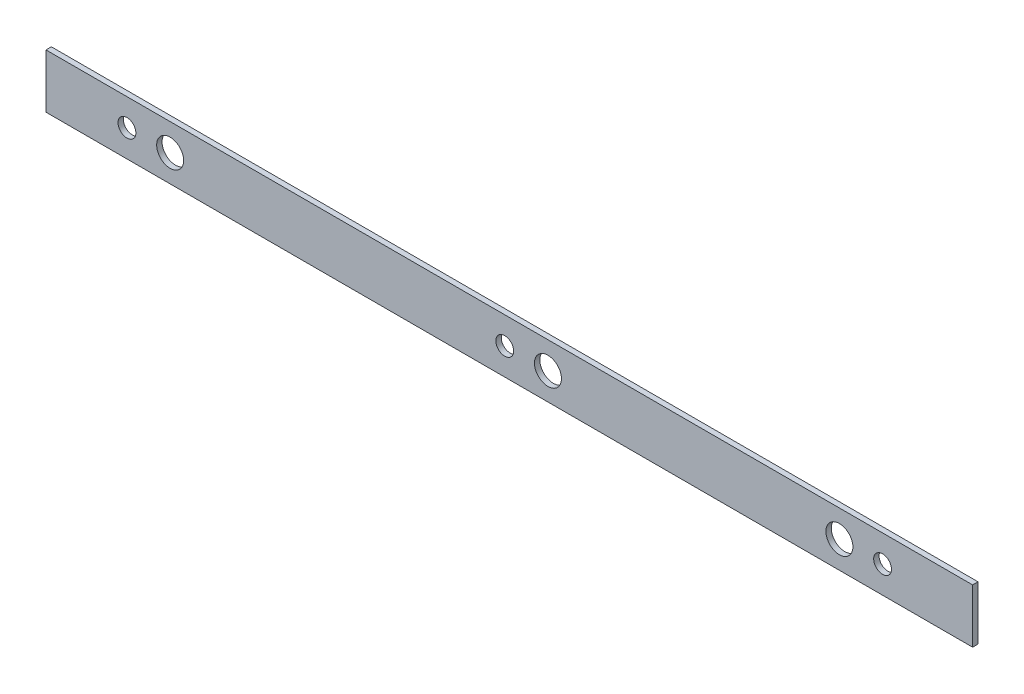
ISO-10303-21;
HEADER;
FILE_DESCRIPTION(('STEP AP214'),'2;1');
FILE_NAME('part.step','',(''),(''),'','','');
FILE_SCHEMA(('AUTOMOTIVE_DESIGN { 1 0 10303 214 1 1 1 1 }'));
ENDSEC;
DATA;
#1=APPLICATION_CONTEXT('core data for automotive mechanical design processes');
#2=APPLICATION_PROTOCOL_DEFINITION('international standard','automotive_design',2000,#1);
#3=PRODUCT_CONTEXT('',#1,'mechanical');
#4=PRODUCT('Part','Part','',(#3));
#5=PRODUCT_RELATED_PRODUCT_CATEGORY('part','',(#4));
#6=PRODUCT_DEFINITION_FORMATION('','',#4);
#7=PRODUCT_DEFINITION_CONTEXT('part definition',#1,'design');
#8=PRODUCT_DEFINITION('design','',#6,#7);
#9=PRODUCT_DEFINITION_SHAPE('','',#8);
#10=(LENGTH_UNIT() NAMED_UNIT(*) SI_UNIT(.MILLI.,.METRE.));
#11=(NAMED_UNIT(*) PLANE_ANGLE_UNIT() SI_UNIT($,.RADIAN.));
#12=(NAMED_UNIT(*) SI_UNIT($,.STERADIAN.) SOLID_ANGLE_UNIT());
#13=UNCERTAINTY_MEASURE_WITH_UNIT(LENGTH_MEASURE(1.E-05),#10,'distance_accuracy_value','');
#14=(GEOMETRIC_REPRESENTATION_CONTEXT(3) GLOBAL_UNCERTAINTY_ASSIGNED_CONTEXT((#13)) GLOBAL_UNIT_ASSIGNED_CONTEXT((#10,
#11,#12)) REPRESENTATION_CONTEXT('',''));
#15=CARTESIAN_POINT('',(0.,0.,0.));
#16=DIRECTION('',(0.,0.,1.));
#17=DIRECTION('',(1.,0.,0.));
#18=AXIS2_PLACEMENT_3D('',#15,#16,#17);
#19=CARTESIAN_POINT('',(0.,0.,1.));
#20=DIRECTION('',(0.,0.,1.));
#21=DIRECTION('',(1.,0.,0.));
#22=AXIS2_PLACEMENT_3D('',#19,#20,#21);
#23=PLANE('',#22);
#24=CARTESIAN_POINT('',(-76.1002778115,267.5,1.));
#25=DIRECTION('',(0.,0.,1.));
#26=DIRECTION('',(1.,0.,0.));
#27=AXIS2_PLACEMENT_3D('',#24,#25,#26);
#28=CIRCLE('',#27,2.50000000000001);
#29=CARTESIAN_POINT('',(-73.6002778115,267.5,1.));
#30=VERTEX_POINT('',#29);
#31=EDGE_CURVE('E166',#30,#30,#28,.T.);
#32=ORIENTED_EDGE('',*,*,#31,.F.);
#33=EDGE_LOOP('',(#32));
#34=FACE_BOUND('',#33,.T.);
#35=CARTESIAN_POINT('',(-138.1002778115,267.5,1.));
#36=DIRECTION('',(0.,0.,1.));
#37=DIRECTION('',(1.,0.,0.));
#38=AXIS2_PLACEMENT_3D('',#35,#36,#37);
#39=CIRCLE('',#38,1.65000000000002);
#40=CARTESIAN_POINT('',(-136.4502778115,267.5,1.));
#41=VERTEX_POINT('',#40);
#42=EDGE_CURVE('E150',#41,#41,#39,.T.);
#43=ORIENTED_EDGE('',*,*,#42,.F.);
#44=EDGE_LOOP('',(#43));
#45=FACE_BOUND('',#44,.T.);
#46=CARTESIAN_POINT('',(-200.1002778115,267.5,1.));
#47=DIRECTION('',(0.,0.,1.));
#48=DIRECTION('',(1.,0.,0.));
#49=AXIS2_PLACEMENT_3D('',#46,#47,#48);
#50=CIRCLE('',#49,2.5);
#51=CARTESIAN_POINT('',(-197.6002778115,267.5,1.));
#52=VERTEX_POINT('',#51);
#53=EDGE_CURVE('E116',#52,#52,#50,.T.);
#54=ORIENTED_EDGE('',*,*,#53,.F.);
#55=EDGE_LOOP('',(#54));
#56=FACE_BOUND('',#55,.T.);
#57=DIRECTION('',(0.,-1.,0.));
#58=VECTOR('',#57,1.);
#59=CARTESIAN_POINT('',(-223.1002778115,272.5,1.));
#60=LINE('',#59,#58);
#61=CARTESIAN_POINT('',(-223.1002778115,272.5,1.));
#62=VERTEX_POINT('',#61);
#63=CARTESIAN_POINT('',(-223.1002778115,262.5,1.));
#64=VERTEX_POINT('',#63);
#65=EDGE_CURVE('E94',#62,#64,#60,.T.);
#66=ORIENTED_EDGE('',*,*,#65,.T.);
#67=DIRECTION('',(1.,0.,0.));
#68=VECTOR('',#67,1.);
#69=CARTESIAN_POINT('',(-223.1002778115,262.5,1.));
#70=LINE('',#69,#68);
#71=CARTESIAN_POINT('',(-51.419079965,262.5,1.));
#72=VERTEX_POINT('',#71);
#73=EDGE_CURVE('E89',#64,#72,#70,.T.);
#74=ORIENTED_EDGE('',*,*,#73,.T.);
#75=DIRECTION('',(0.,1.,0.));
#76=VECTOR('',#75,1.);
#77=CARTESIAN_POINT('',(-51.419079965,272.5,1.));
#78=LINE('',#77,#76);
#79=CARTESIAN_POINT('',(-51.419079965,272.5,1.));
#80=VERTEX_POINT('',#79);
#81=EDGE_CURVE('E92',#72,#80,#78,.T.);
#82=ORIENTED_EDGE('',*,*,#81,.T.);
#83=DIRECTION('',(-1.,0.,0.));
#84=VECTOR('',#83,1.);
#85=CARTESIAN_POINT('',(-223.1002778115,272.5,1.));
#86=LINE('',#85,#84);
#87=EDGE_CURVE('E59',#80,#62,#86,.T.);
#88=ORIENTED_EDGE('',*,*,#87,.T.);
#89=EDGE_LOOP('',(#66,#74,#82,#88));
#90=FACE_BOUND('',#89,.T.);
#91=CARTESIAN_POINT('',(-208.1002778115,267.5,1.));
#92=DIRECTION('',(0.,0.,1.));
#93=DIRECTION('',(1.,0.,0.));
#94=AXIS2_PLACEMENT_3D('',#91,#92,#93);
#95=CIRCLE('',#94,1.65000000000002);
#96=CARTESIAN_POINT('',(-206.4502778115,267.5,1.));
#97=VERTEX_POINT('',#96);
#98=EDGE_CURVE('E142',#97,#97,#95,.T.);
#99=ORIENTED_EDGE('',*,*,#98,.F.);
#100=EDGE_LOOP('',(#99));
#101=FACE_BOUND('',#100,.T.);
#102=CARTESIAN_POINT('',(-130.1002778115,267.5,1.));
#103=DIRECTION('',(0.,0.,1.));
#104=DIRECTION('',(1.,0.,0.));
#105=AXIS2_PLACEMENT_3D('',#102,#103,#104);
#106=CIRCLE('',#105,2.5);
#107=CARTESIAN_POINT('',(-127.6002778115,267.5,1.));
#108=VERTEX_POINT('',#107);
#109=EDGE_CURVE('E158',#108,#108,#106,.T.);
#110=ORIENTED_EDGE('',*,*,#109,.F.);
#111=EDGE_LOOP('',(#110));
#112=FACE_BOUND('',#111,.T.);
#113=CARTESIAN_POINT('',(-68.1002778115,267.5,1.));
#114=DIRECTION('',(0.,0.,1.));
#115=DIRECTION('',(1.,0.,0.));
#116=AXIS2_PLACEMENT_3D('',#113,#114,#115);
#117=CIRCLE('',#116,1.65000000000001);
#118=CARTESIAN_POINT('',(-66.4502778115,267.5,1.));
#119=VERTEX_POINT('',#118);
#120=EDGE_CURVE('E174',#119,#119,#117,.T.);
#121=ORIENTED_EDGE('',*,*,#120,.F.);
#122=EDGE_LOOP('',(#121));
#123=FACE_BOUND('',#122,.T.);
#124=ADVANCED_FACE('F41',(#34,#45,#56,#90,#101,#112,#123),#23,.T.);
#125=CARTESIAN_POINT('',(0.,0.,0.));
#126=DIRECTION('',(0.,0.,1.));
#127=DIRECTION('',(1.,0.,0.));
#128=AXIS2_PLACEMENT_3D('',#125,#126,#127);
#129=PLANE('',#128);
#130=DIRECTION('',(0.,-1.,0.));
#131=VECTOR('',#130,1.);
#132=CARTESIAN_POINT('',(-223.1002778115,272.5,0.));
#133=LINE('',#132,#131);
#134=CARTESIAN_POINT('',(-223.1002778115,272.5,0.));
#135=VERTEX_POINT('',#134);
#136=CARTESIAN_POINT('',(-223.1002778115,262.5,0.));
#137=VERTEX_POINT('',#136);
#138=EDGE_CURVE('E112',#135,#137,#133,.T.);
#139=ORIENTED_EDGE('',*,*,#138,.F.);
#140=DIRECTION('',(-1.,0.,0.));
#141=VECTOR('',#140,1.);
#142=CARTESIAN_POINT('',(-223.1002778115,272.5,0.));
#143=LINE('',#142,#141);
#144=CARTESIAN_POINT('',(-51.419079965,272.5,0.));
#145=VERTEX_POINT('',#144);
#146=EDGE_CURVE('E82',#145,#135,#143,.T.);
#147=ORIENTED_EDGE('',*,*,#146,.F.);
#148=DIRECTION('',(0.,1.,0.));
#149=VECTOR('',#148,1.);
#150=CARTESIAN_POINT('',(-51.419079965,272.5,0.));
#151=LINE('',#150,#149);
#152=CARTESIAN_POINT('',(-51.419079965,262.5,0.));
#153=VERTEX_POINT('',#152);
#154=EDGE_CURVE('E76',#153,#145,#151,.T.);
#155=ORIENTED_EDGE('',*,*,#154,.F.);
#156=DIRECTION('',(1.,0.,0.));
#157=VECTOR('',#156,1.);
#158=CARTESIAN_POINT('',(-223.1002778115,262.5,0.));
#159=LINE('',#158,#157);
#160=EDGE_CURVE('E99',#137,#153,#159,.T.);
#161=ORIENTED_EDGE('',*,*,#160,.F.);
#162=EDGE_LOOP('',(#139,#147,#155,#161));
#163=FACE_BOUND('',#162,.T.);
#164=CARTESIAN_POINT('',(-200.1002778115,267.5,0.));
#165=DIRECTION('',(0.,0.,1.));
#166=DIRECTION('',(1.,0.,0.));
#167=AXIS2_PLACEMENT_3D('',#164,#165,#166);
#168=CIRCLE('',#167,2.5);
#169=CARTESIAN_POINT('',(-197.6002778115,267.5,0.));
#170=VERTEX_POINT('',#169);
#171=EDGE_CURVE('E138',#170,#170,#168,.T.);
#172=ORIENTED_EDGE('',*,*,#171,.T.);
#173=EDGE_LOOP('',(#172));
#174=FACE_BOUND('',#173,.T.);
#175=CARTESIAN_POINT('',(-208.1002778115,267.5,0.));
#176=DIRECTION('',(0.,0.,1.));
#177=DIRECTION('',(1.,0.,0.));
#178=AXIS2_PLACEMENT_3D('',#175,#176,#177);
#179=CIRCLE('',#178,1.65000000000002);
#180=CARTESIAN_POINT('',(-206.4502778115,267.5,0.));
#181=VERTEX_POINT('',#180);
#182=EDGE_CURVE('E146',#181,#181,#179,.T.);
#183=ORIENTED_EDGE('',*,*,#182,.T.);
#184=EDGE_LOOP('',(#183));
#185=FACE_BOUND('',#184,.T.);
#186=CARTESIAN_POINT('',(-138.1002778115,267.5,0.));
#187=DIRECTION('',(0.,0.,1.));
#188=DIRECTION('',(1.,0.,0.));
#189=AXIS2_PLACEMENT_3D('',#186,#187,#188);
#190=CIRCLE('',#189,1.65000000000002);
#191=CARTESIAN_POINT('',(-136.4502778115,267.5,0.));
#192=VERTEX_POINT('',#191);
#193=EDGE_CURVE('E154',#192,#192,#190,.T.);
#194=ORIENTED_EDGE('',*,*,#193,.T.);
#195=EDGE_LOOP('',(#194));
#196=FACE_BOUND('',#195,.T.);
#197=CARTESIAN_POINT('',(-130.1002778115,267.5,0.));
#198=DIRECTION('',(0.,0.,1.));
#199=DIRECTION('',(1.,0.,0.));
#200=AXIS2_PLACEMENT_3D('',#197,#198,#199);
#201=CIRCLE('',#200,2.5);
#202=CARTESIAN_POINT('',(-127.6002778115,267.5,0.));
#203=VERTEX_POINT('',#202);
#204=EDGE_CURVE('E162',#203,#203,#201,.T.);
#205=ORIENTED_EDGE('',*,*,#204,.T.);
#206=EDGE_LOOP('',(#205));
#207=FACE_BOUND('',#206,.T.);
#208=CARTESIAN_POINT('',(-76.1002778115,267.5,0.));
#209=DIRECTION('',(0.,0.,1.));
#210=DIRECTION('',(1.,0.,0.));
#211=AXIS2_PLACEMENT_3D('',#208,#209,#210);
#212=CIRCLE('',#211,2.50000000000001);
#213=CARTESIAN_POINT('',(-73.6002778115,267.5,0.));
#214=VERTEX_POINT('',#213);
#215=EDGE_CURVE('E170',#214,#214,#212,.T.);
#216=ORIENTED_EDGE('',*,*,#215,.T.);
#217=EDGE_LOOP('',(#216));
#218=FACE_BOUND('',#217,.T.);
#219=CARTESIAN_POINT('',(-68.1002778115,267.5,0.));
#220=DIRECTION('',(0.,0.,1.));
#221=DIRECTION('',(1.,0.,0.));
#222=AXIS2_PLACEMENT_3D('',#219,#220,#221);
#223=CIRCLE('',#222,1.65000000000001);
#224=CARTESIAN_POINT('',(-66.4502778115,267.5,0.));
#225=VERTEX_POINT('',#224);
#226=EDGE_CURVE('E178',#225,#225,#223,.T.);
#227=ORIENTED_EDGE('',*,*,#226,.T.);
#228=EDGE_LOOP('',(#227));
#229=FACE_BOUND('',#228,.T.);
#230=ADVANCED_FACE('F131',(#163,#174,#185,#196,#207,#218,#229),#129,.F.);
#231=CARTESIAN_POINT('',(-223.1002778115,272.5,1.));
#232=DIRECTION('',(1.,0.,0.));
#233=DIRECTION('',(0.,0.,-1.));
#234=AXIS2_PLACEMENT_3D('',#231,#232,#233);
#235=PLANE('',#234);
#236=ORIENTED_EDGE('',*,*,#138,.T.);
#237=DIRECTION('',(0.,0.,-1.));
#238=VECTOR('',#237,1.);
#239=CARTESIAN_POINT('',(-223.1002778115,262.5,1.));
#240=LINE('',#239,#238);
#241=EDGE_CURVE('E11',#64,#137,#240,.T.);
#242=ORIENTED_EDGE('',*,*,#241,.F.);
#243=ORIENTED_EDGE('',*,*,#65,.F.);
#244=DIRECTION('',(0.,0.,-1.));
#245=VECTOR('',#244,1.);
#246=CARTESIAN_POINT('',(-223.1002778115,272.5,1.));
#247=LINE('',#246,#245);
#248=EDGE_CURVE('E108',#62,#135,#247,.T.);
#249=ORIENTED_EDGE('',*,*,#248,.T.);
#250=EDGE_LOOP('',(#236,#242,#243,#249));
#251=FACE_BOUND('',#250,.T.);
#252=ADVANCED_FACE('F43',(#251),#235,.F.);
#253=CARTESIAN_POINT('',(-223.1002778115,262.5,1.));
#254=DIRECTION('',(0.,1.,0.));
#255=DIRECTION('',(0.,0.,1.));
#256=AXIS2_PLACEMENT_3D('',#253,#254,#255);
#257=PLANE('',#256);
#258=ORIENTED_EDGE('',*,*,#160,.T.);
#259=DIRECTION('',(0.,0.,-1.));
#260=VECTOR('',#259,1.);
#261=CARTESIAN_POINT('',(-51.419079965,262.5,1.));
#262=LINE('',#261,#260);
#263=EDGE_CURVE('E51',#72,#153,#262,.T.);
#264=ORIENTED_EDGE('',*,*,#263,.F.);
#265=ORIENTED_EDGE('',*,*,#73,.F.);
#266=ORIENTED_EDGE('',*,*,#241,.T.);
#267=EDGE_LOOP('',(#258,#264,#265,#266));
#268=FACE_BOUND('',#267,.T.);
#269=ADVANCED_FACE('F98',(#268),#257,.F.);
#270=CARTESIAN_POINT('',(-51.419079965,272.5,1.));
#271=DIRECTION('',(-1.,0.,0.));
#272=DIRECTION('',(0.,0.,1.));
#273=AXIS2_PLACEMENT_3D('',#270,#271,#272);
#274=PLANE('',#273);
#275=ORIENTED_EDGE('',*,*,#154,.T.);
#276=DIRECTION('',(0.,0.,-1.));
#277=VECTOR('',#276,1.);
#278=CARTESIAN_POINT('',(-51.419079965,272.5,1.));
#279=LINE('',#278,#277);
#280=EDGE_CURVE('E101',#80,#145,#279,.T.);
#281=ORIENTED_EDGE('',*,*,#280,.F.);
#282=ORIENTED_EDGE('',*,*,#81,.F.);
#283=ORIENTED_EDGE('',*,*,#263,.T.);
#284=EDGE_LOOP('',(#275,#281,#282,#283));
#285=FACE_BOUND('',#284,.T.);
#286=ADVANCED_FACE('F102',(#285),#274,.F.);
#287=CARTESIAN_POINT('',(-223.1002778115,272.5,1.));
#288=DIRECTION('',(0.,-1.,0.));
#289=DIRECTION('',(0.,0.,-1.));
#290=AXIS2_PLACEMENT_3D('',#287,#288,#289);
#291=PLANE('',#290);
#292=ORIENTED_EDGE('',*,*,#146,.T.);
#293=ORIENTED_EDGE('',*,*,#248,.F.);
#294=ORIENTED_EDGE('',*,*,#87,.F.);
#295=ORIENTED_EDGE('',*,*,#280,.T.);
#296=EDGE_LOOP('',(#292,#293,#294,#295));
#297=FACE_BOUND('',#296,.T.);
#298=ADVANCED_FACE('F128',(#297),#291,.F.);
#299=CARTESIAN_POINT('',(-200.1002778115,267.5,1.));
#300=DIRECTION('',(0.,0.,-1.));
#301=DIRECTION('',(-1.,0.,0.));
#302=AXIS2_PLACEMENT_3D('',#299,#300,#301);
#303=CYLINDRICAL_SURFACE('',#302,2.5);
#304=ORIENTED_EDGE('',*,*,#53,.T.);
#305=EDGE_LOOP('',(#304));
#306=FACE_BOUND('',#305,.T.);
#307=ORIENTED_EDGE('',*,*,#171,.F.);
#308=EDGE_LOOP('',(#307));
#309=FACE_BOUND('',#308,.T.);
#310=ADVANCED_FACE('F201',(#306,#309),#303,.F.);
#311=CARTESIAN_POINT('',(-208.1002778115,267.5,1.));
#312=DIRECTION('',(0.,0.,-1.));
#313=DIRECTION('',(-1.,0.,0.));
#314=AXIS2_PLACEMENT_3D('',#311,#312,#313);
#315=CYLINDRICAL_SURFACE('',#314,1.65000000000002);
#316=ORIENTED_EDGE('',*,*,#98,.T.);
#317=EDGE_LOOP('',(#316));
#318=FACE_BOUND('',#317,.T.);
#319=ORIENTED_EDGE('',*,*,#182,.F.);
#320=EDGE_LOOP('',(#319));
#321=FACE_BOUND('',#320,.T.);
#322=ADVANCED_FACE('F256',(#318,#321),#315,.F.);
#323=CARTESIAN_POINT('',(-138.1002778115,267.5,1.));
#324=DIRECTION('',(0.,0.,-1.));
#325=DIRECTION('',(-1.,0.,0.));
#326=AXIS2_PLACEMENT_3D('',#323,#324,#325);
#327=CYLINDRICAL_SURFACE('',#326,1.65000000000002);
#328=ORIENTED_EDGE('',*,*,#42,.T.);
#329=EDGE_LOOP('',(#328));
#330=FACE_BOUND('',#329,.T.);
#331=ORIENTED_EDGE('',*,*,#193,.F.);
#332=EDGE_LOOP('',(#331));
#333=FACE_BOUND('',#332,.T.);
#334=ADVANCED_FACE('F265',(#330,#333),#327,.F.);
#335=CARTESIAN_POINT('',(-130.1002778115,267.5,1.));
#336=DIRECTION('',(0.,0.,-1.));
#337=DIRECTION('',(-1.,0.,0.));
#338=AXIS2_PLACEMENT_3D('',#335,#336,#337);
#339=CYLINDRICAL_SURFACE('',#338,2.5);
#340=ORIENTED_EDGE('',*,*,#109,.T.);
#341=EDGE_LOOP('',(#340));
#342=FACE_BOUND('',#341,.T.);
#343=ORIENTED_EDGE('',*,*,#204,.F.);
#344=EDGE_LOOP('',(#343));
#345=FACE_BOUND('',#344,.T.);
#346=ADVANCED_FACE('F274',(#342,#345),#339,.F.);
#347=CARTESIAN_POINT('',(-76.1002778115,267.5,1.));
#348=DIRECTION('',(0.,0.,-1.));
#349=DIRECTION('',(-1.,0.,0.));
#350=AXIS2_PLACEMENT_3D('',#347,#348,#349);
#351=CYLINDRICAL_SURFACE('',#350,2.50000000000001);
#352=ORIENTED_EDGE('',*,*,#31,.T.);
#353=EDGE_LOOP('',(#352));
#354=FACE_BOUND('',#353,.T.);
#355=ORIENTED_EDGE('',*,*,#215,.F.);
#356=EDGE_LOOP('',(#355));
#357=FACE_BOUND('',#356,.T.);
#358=ADVANCED_FACE('F284',(#354,#357),#351,.F.);
#359=CARTESIAN_POINT('',(-68.1002778115,267.5,1.));
#360=DIRECTION('',(0.,0.,-1.));
#361=DIRECTION('',(-1.,0.,0.));
#362=AXIS2_PLACEMENT_3D('',#359,#360,#361);
#363=CYLINDRICAL_SURFACE('',#362,1.65000000000001);
#364=ORIENTED_EDGE('',*,*,#120,.T.);
#365=EDGE_LOOP('',(#364));
#366=FACE_BOUND('',#365,.T.);
#367=ORIENTED_EDGE('',*,*,#226,.F.);
#368=EDGE_LOOP('',(#367));
#369=FACE_BOUND('',#368,.T.);
#370=ADVANCED_FACE('F188',(#366,#369),#363,.F.);
#371=CLOSED_SHELL('',(#124,#230,#252,#269,#286,#298,#310,#322,#334,#346,#358,#370));
#372=MANIFOLD_SOLID_BREP('B2',#371);
#373=ADVANCED_BREP_SHAPE_REPRESENTATION('',(#18,#372),#14);
#374=SHAPE_DEFINITION_REPRESENTATION(#9,#373);
ENDSEC;
END-ISO-10303-21;
